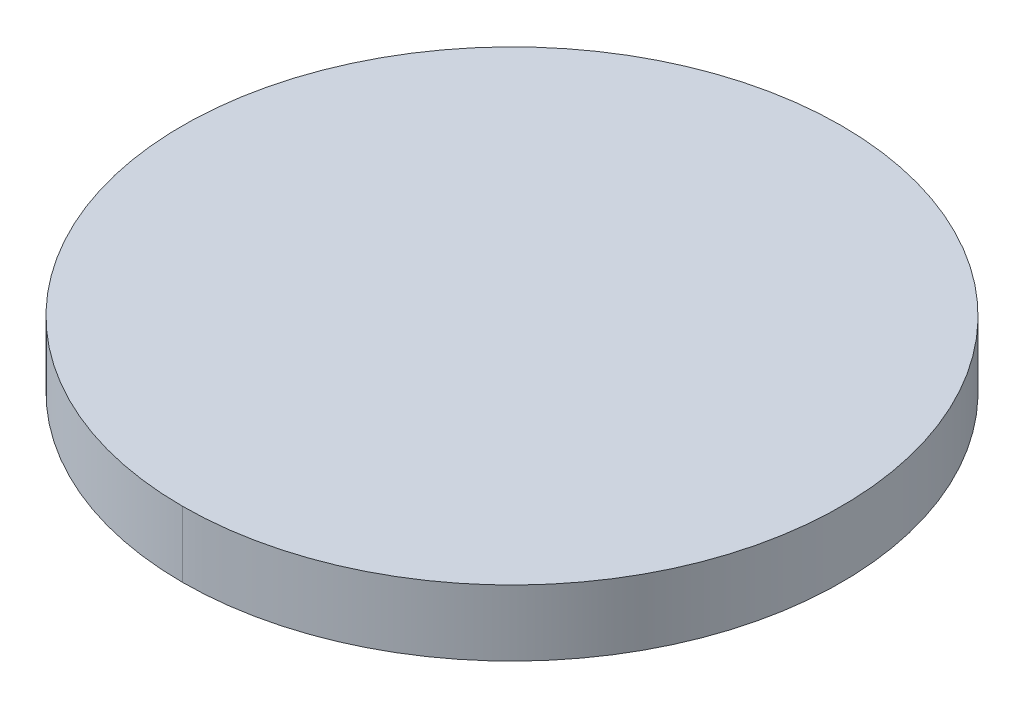
ISO-10303-21;
HEADER;
FILE_DESCRIPTION(('STEP AP214'),'2;1');
FILE_NAME('part.step','',(''),(''),'','','');
FILE_SCHEMA(('AUTOMOTIVE_DESIGN { 1 0 10303 214 1 1 1 1 }'));
ENDSEC;
DATA;
#1=APPLICATION_CONTEXT('core data for automotive mechanical design processes');
#2=APPLICATION_PROTOCOL_DEFINITION('international standard','automotive_design',2000,#1);
#3=PRODUCT_CONTEXT('',#1,'mechanical');
#4=PRODUCT('Part','Part','',(#3));
#5=PRODUCT_RELATED_PRODUCT_CATEGORY('part','',(#4));
#6=PRODUCT_DEFINITION_FORMATION('','',#4);
#7=PRODUCT_DEFINITION_CONTEXT('part definition',#1,'design');
#8=PRODUCT_DEFINITION('design','',#6,#7);
#9=PRODUCT_DEFINITION_SHAPE('','',#8);
#10=(LENGTH_UNIT() NAMED_UNIT(*) SI_UNIT(.MILLI.,.METRE.));
#11=(NAMED_UNIT(*) PLANE_ANGLE_UNIT() SI_UNIT($,.RADIAN.));
#12=(NAMED_UNIT(*) SI_UNIT($,.STERADIAN.) SOLID_ANGLE_UNIT());
#13=UNCERTAINTY_MEASURE_WITH_UNIT(LENGTH_MEASURE(1.E-05),#10,'distance_accuracy_value','');
#14=(GEOMETRIC_REPRESENTATION_CONTEXT(3) GLOBAL_UNCERTAINTY_ASSIGNED_CONTEXT((#13)) GLOBAL_UNIT_ASSIGNED_CONTEXT((#10,
#11,#12)) REPRESENTATION_CONTEXT('',''));
#15=CARTESIAN_POINT('',(0.,0.,0.));
#16=DIRECTION('',(0.,0.,1.));
#17=DIRECTION('',(1.,0.,0.));
#18=AXIS2_PLACEMENT_3D('',#15,#16,#17);
#19=CARTESIAN_POINT('',(0.,0.1,0.));
#20=DIRECTION('',(0.,1.,0.));
#21=DIRECTION('',(1.,0.,0.));
#22=AXIS2_PLACEMENT_3D('',#19,#20,#21);
#23=PLANE('',#22);
#24=CARTESIAN_POINT('',(0.,0.1,0.));
#25=DIRECTION('',(0.,-1.,0.));
#26=DIRECTION('',(0.,0.,1.));
#27=AXIS2_PLACEMENT_3D('',#24,#25,#26);
#28=CIRCLE('',#27,0.5);
#29=CARTESIAN_POINT('',(0.,0.1,0.5));
#30=VERTEX_POINT('',#29);
#31=CARTESIAN_POINT('',(0.,0.1,-0.5));
#32=VERTEX_POINT('',#31);
#33=EDGE_CURVE('E11',#30,#32,#28,.T.);
#34=ORIENTED_EDGE('',*,*,#33,.F.);
#35=CARTESIAN_POINT('',(0.,0.1,0.));
#36=DIRECTION('',(0.,-1.,0.));
#37=DIRECTION('',(0.,0.,1.));
#38=AXIS2_PLACEMENT_3D('',#35,#36,#37);
#39=CIRCLE('',#38,0.5);
#40=EDGE_CURVE('E65',#32,#30,#39,.T.);
#41=ORIENTED_EDGE('',*,*,#40,.F.);
#42=EDGE_LOOP('',(#34,#41));
#43=FACE_BOUND('',#42,.T.);
#44=ADVANCED_FACE('F16',(#43),#23,.T.);
#45=CARTESIAN_POINT('',(0.,0.,0.));
#46=DIRECTION('',(0.,1.,0.));
#47=DIRECTION('',(0.,0.,1.));
#48=AXIS2_PLACEMENT_3D('',#45,#46,#47);
#49=CYLINDRICAL_SURFACE('',#48,0.5);
#50=DIRECTION('',(0.,1.,0.));
#51=VECTOR('',#50,1.);
#52=CARTESIAN_POINT('',(0.,0.,-0.5));
#53=LINE('',#52,#51);
#54=CARTESIAN_POINT('',(0.,0.,-0.5));
#55=VERTEX_POINT('',#54);
#56=EDGE_CURVE('E60',#55,#32,#53,.T.);
#57=ORIENTED_EDGE('',*,*,#56,.F.);
#58=CARTESIAN_POINT('',(0.,0.,0.));
#59=DIRECTION('',(0.,1.,0.));
#60=DIRECTION('',(0.,0.,1.));
#61=AXIS2_PLACEMENT_3D('',#58,#59,#60);
#62=CIRCLE('',#61,0.5);
#63=CARTESIAN_POINT('',(0.,0.,0.5));
#64=VERTEX_POINT('',#63);
#65=EDGE_CURVE('E19',#55,#64,#62,.T.);
#66=ORIENTED_EDGE('',*,*,#65,.T.);
#67=DIRECTION('',(0.,1.,0.));
#68=VECTOR('',#67,1.);
#69=CARTESIAN_POINT('',(0.,0.,0.5));
#70=LINE('',#69,#68);
#71=EDGE_CURVE('E58',#64,#30,#70,.T.);
#72=ORIENTED_EDGE('',*,*,#71,.T.);
#73=ORIENTED_EDGE('',*,*,#33,.T.);
#74=EDGE_LOOP('',(#57,#66,#72,#73));
#75=FACE_BOUND('',#74,.T.);
#76=ADVANCED_FACE('F61',(#75),#49,.T.);
#77=CARTESIAN_POINT('',(0.,0.,0.));
#78=DIRECTION('',(0.,1.,0.));
#79=DIRECTION('',(1.,0.,0.));
#80=AXIS2_PLACEMENT_3D('',#77,#78,#79);
#81=PLANE('',#80);
#82=CARTESIAN_POINT('',(0.,0.,0.));
#83=DIRECTION('',(0.,1.,0.));
#84=DIRECTION('',(0.,0.,1.));
#85=AXIS2_PLACEMENT_3D('',#82,#83,#84);
#86=CIRCLE('',#85,0.5);
#87=EDGE_CURVE('E56',#64,#55,#86,.T.);
#88=ORIENTED_EDGE('',*,*,#87,.F.);
#89=ORIENTED_EDGE('',*,*,#65,.F.);
#90=EDGE_LOOP('',(#88,#89));
#91=FACE_BOUND('',#90,.T.);
#92=ADVANCED_FACE('F54',(#91),#81,.F.);
#93=CARTESIAN_POINT('',(0.,0.,0.));
#94=DIRECTION('',(0.,1.,0.));
#95=DIRECTION('',(0.,0.,1.));
#96=AXIS2_PLACEMENT_3D('',#93,#94,#95);
#97=CYLINDRICAL_SURFACE('',#96,0.5);
#98=ORIENTED_EDGE('',*,*,#87,.T.);
#99=ORIENTED_EDGE('',*,*,#56,.T.);
#100=ORIENTED_EDGE('',*,*,#40,.T.);
#101=ORIENTED_EDGE('',*,*,#71,.F.);
#102=EDGE_LOOP('',(#98,#99,#100,#101));
#103=FACE_BOUND('',#102,.T.);
#104=ADVANCED_FACE('F67',(#103),#97,.T.);
#105=CLOSED_SHELL('',(#44,#76,#92,#104));
#106=MANIFOLD_SOLID_BREP('B1',#105);
#107=ADVANCED_BREP_SHAPE_REPRESENTATION('',(#18,#106),#14);
#108=SHAPE_DEFINITION_REPRESENTATION(#9,#107);
ENDSEC;
END-ISO-10303-21;
